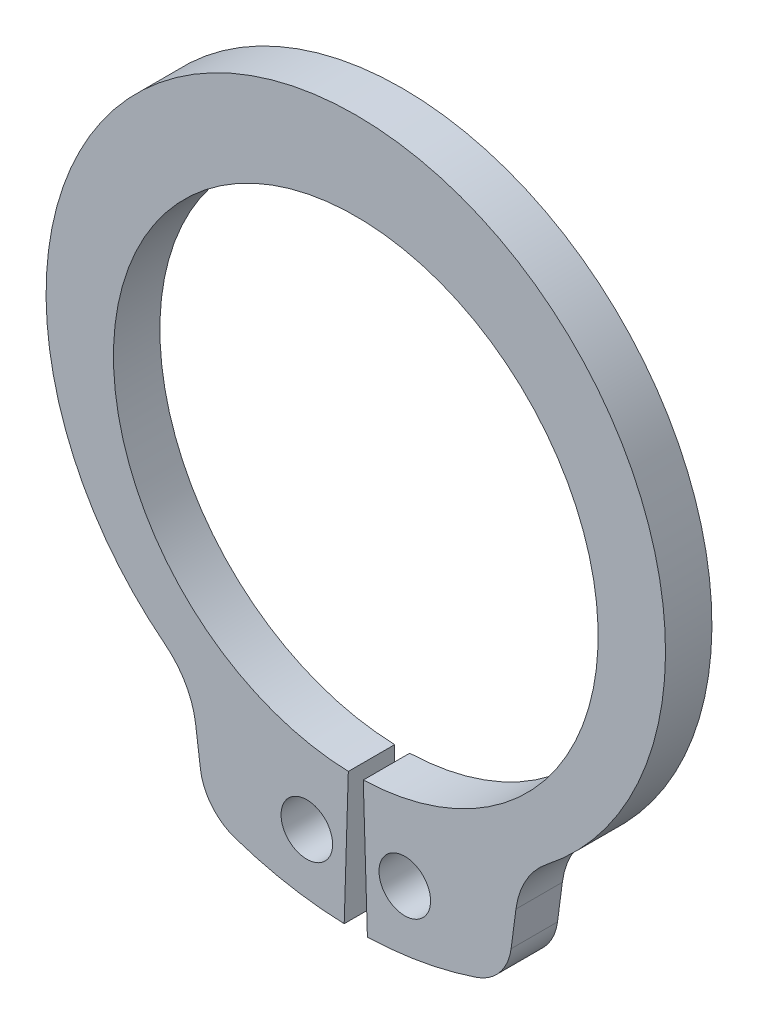
ISO-10303-21;
HEADER;
FILE_DESCRIPTION(('STEP AP214'),'2;1');
FILE_NAME('part.step','',(''),(''),'','','');
FILE_SCHEMA(('AUTOMOTIVE_DESIGN { 1 0 10303 214 1 1 1 1 }'));
ENDSEC;
DATA;
#1=APPLICATION_CONTEXT('core data for automotive mechanical design processes');
#2=APPLICATION_PROTOCOL_DEFINITION('international standard','automotive_design',2000,#1);
#3=PRODUCT_CONTEXT('',#1,'mechanical');
#4=PRODUCT('Part','Part','',(#3));
#5=PRODUCT_RELATED_PRODUCT_CATEGORY('part','',(#4));
#6=PRODUCT_DEFINITION_FORMATION('','',#4);
#7=PRODUCT_DEFINITION_CONTEXT('part definition',#1,'design');
#8=PRODUCT_DEFINITION('design','',#6,#7);
#9=PRODUCT_DEFINITION_SHAPE('','',#8);
#10=(LENGTH_UNIT() NAMED_UNIT(*) SI_UNIT(.MILLI.,.METRE.));
#11=(NAMED_UNIT(*) PLANE_ANGLE_UNIT() SI_UNIT($,.RADIAN.));
#12=(NAMED_UNIT(*) SI_UNIT($,.STERADIAN.) SOLID_ANGLE_UNIT());
#13=UNCERTAINTY_MEASURE_WITH_UNIT(LENGTH_MEASURE(1.E-05),#10,'distance_accuracy_value','');
#14=(GEOMETRIC_REPRESENTATION_CONTEXT(3) GLOBAL_UNCERTAINTY_ASSIGNED_CONTEXT((#13)) GLOBAL_UNIT_ASSIGNED_CONTEXT((#10,
#11,#12)) REPRESENTATION_CONTEXT('',''));
#15=CARTESIAN_POINT('',(0.,0.,0.));
#16=DIRECTION('',(0.,0.,1.));
#17=DIRECTION('',(1.,0.,0.));
#18=AXIS2_PLACEMENT_3D('',#15,#16,#17);
#19=CARTESIAN_POINT('',(0.,0.,-0.9));
#20=DIRECTION('',(0.,0.,1.));
#21=DIRECTION('',(1.,0.,0.));
#22=AXIS2_PLACEMENT_3D('',#19,#20,#21);
#23=CYLINDRICAL_SURFACE('',#22,4.7);
#24=CARTESIAN_POINT('',(0.,0.,0.));
#25=DIRECTION('',(0.,0.,-1.));
#26=DIRECTION('',(1.,0.,0.));
#27=AXIS2_PLACEMENT_3D('',#24,#25,#26);
#28=CIRCLE('',#27,4.7);
#29=CARTESIAN_POINT('',(-0.14486301369863,-4.69776699158889,0.));
#30=VERTEX_POINT('',#29);
#31=CARTESIAN_POINT('',(0.14486301369863,-4.69776699158889,0.));
#32=VERTEX_POINT('',#31);
#33=EDGE_CURVE('E153',#30,#32,#28,.T.);
#34=ORIENTED_EDGE('',*,*,#33,.F.);
#35=DIRECTION('',(0.,0.,1.));
#36=VECTOR('',#35,1.);
#37=CARTESIAN_POINT('',(-0.14486301369863,-4.69776699158889,-0.9));
#38=LINE('',#37,#36);
#39=CARTESIAN_POINT('',(-0.14486301369863,-4.69776699158889,-0.9));
#40=VERTEX_POINT('',#39);
#41=EDGE_CURVE('E11',#40,#30,#38,.T.);
#42=ORIENTED_EDGE('',*,*,#41,.F.);
#43=CARTESIAN_POINT('',(0.,0.,-0.9));
#44=DIRECTION('',(0.,0.,-1.));
#45=DIRECTION('',(1.,0.,0.));
#46=AXIS2_PLACEMENT_3D('',#43,#44,#45);
#47=CIRCLE('',#46,4.7);
#48=CARTESIAN_POINT('',(0.14486301369863,-4.69776699158889,-0.9));
#49=VERTEX_POINT('',#48);
#50=EDGE_CURVE('E186',#40,#49,#47,.T.);
#51=ORIENTED_EDGE('',*,*,#50,.T.);
#52=DIRECTION('',(0.,0.,1.));
#53=VECTOR('',#52,1.);
#54=CARTESIAN_POINT('',(0.14486301369863,-4.69776699158889,-0.9));
#55=LINE('',#54,#53);
#56=EDGE_CURVE('E35',#49,#32,#55,.T.);
#57=ORIENTED_EDGE('',*,*,#56,.T.);
#58=EDGE_LOOP('',(#34,#42,#51,#57));
#59=FACE_BOUND('',#58,.T.);
#60=ADVANCED_FACE('F32',(#59),#23,.F.);
#61=CARTESIAN_POINT('',(-0.14486301369863,-4.69776699158889,-0.9));
#62=DIRECTION('',(0.999524891827424,-0.0308219178082192,0.));
#63=DIRECTION('',(0.0308219178082192,0.999524891827424,0.));
#64=AXIS2_PLACEMENT_3D('',#61,#62,#63);
#65=PLANE('',#64);
#66=DIRECTION('',(0.0308219178082192,0.999524891827424,0.));
#67=VECTOR('',#66,1.);
#68=CARTESIAN_POINT('',(-0.14486301369863,-4.69776699158889,0.));
#69=LINE('',#68,#67);
#70=CARTESIAN_POINT('',(-0.225,-7.2965317103402,0.));
#71=VERTEX_POINT('',#70);
#72=EDGE_CURVE('E184',#71,#30,#69,.T.);
#73=ORIENTED_EDGE('',*,*,#72,.F.);
#74=DIRECTION('',(0.,0.,1.));
#75=VECTOR('',#74,1.);
#76=CARTESIAN_POINT('',(-0.225,-7.2965317103402,-0.9));
#77=LINE('',#76,#75);
#78=CARTESIAN_POINT('',(-0.225,-7.2965317103402,-0.9));
#79=VERTEX_POINT('',#78);
#80=EDGE_CURVE('E41',#79,#71,#77,.T.);
#81=ORIENTED_EDGE('',*,*,#80,.F.);
#82=DIRECTION('',(0.0308219178082192,0.999524891827424,0.));
#83=VECTOR('',#82,1.);
#84=CARTESIAN_POINT('',(-0.14486301369863,-4.69776699158889,-0.9));
#85=LINE('',#84,#83);
#86=EDGE_CURVE('E143',#79,#40,#85,.T.);
#87=ORIENTED_EDGE('',*,*,#86,.T.);
#88=ORIENTED_EDGE('',*,*,#41,.T.);
#89=EDGE_LOOP('',(#73,#81,#87,#88));
#90=FACE_BOUND('',#89,.T.);
#91=ADVANCED_FACE('F206',(#90),#65,.T.);
#92=CARTESIAN_POINT('',(0.,0.,-0.9));
#93=DIRECTION('',(0.,0.,1.));
#94=DIRECTION('',(1.,0.,0.));
#95=AXIS2_PLACEMENT_3D('',#92,#93,#94);
#96=CYLINDRICAL_SURFACE('',#95,7.3);
#97=CARTESIAN_POINT('',(0.,0.,0.));
#98=DIRECTION('',(0.,0.,1.));
#99=DIRECTION('',(1.,0.,0.));
#100=AXIS2_PLACEMENT_3D('',#97,#98,#99);
#101=CIRCLE('',#100,7.3);
#102=CARTESIAN_POINT('',(-2.34132501821365,-6.91434719688611,0.));
#103=VERTEX_POINT('',#102);
#104=EDGE_CURVE('E130',#103,#71,#101,.T.);
#105=ORIENTED_EDGE('',*,*,#104,.F.);
#106=DIRECTION('',(0.,0.,1.));
#107=VECTOR('',#106,1.);
#108=CARTESIAN_POINT('',(-2.34132501821365,-6.91434719688611,-0.9));
#109=LINE('',#108,#107);
#110=CARTESIAN_POINT('',(-2.34132501821365,-6.91434719688611,-0.9));
#111=VERTEX_POINT('',#110);
#112=EDGE_CURVE('E125',#111,#103,#109,.T.);
#113=ORIENTED_EDGE('',*,*,#112,.F.);
#114=CARTESIAN_POINT('',(0.,0.,-0.9));
#115=DIRECTION('',(0.,0.,1.));
#116=DIRECTION('',(1.,0.,0.));
#117=AXIS2_PLACEMENT_3D('',#114,#115,#116);
#118=CIRCLE('',#117,7.3);
#119=EDGE_CURVE('E128',#111,#79,#118,.T.);
#120=ORIENTED_EDGE('',*,*,#119,.T.);
#121=ORIENTED_EDGE('',*,*,#80,.T.);
#122=EDGE_LOOP('',(#105,#113,#120,#121));
#123=FACE_BOUND('',#122,.T.);
#124=ADVANCED_FACE('F127',(#123),#96,.T.);
#125=CARTESIAN_POINT('',(-2.02059556366383,-5.96717634799761,-0.9));
#126=DIRECTION('',(0.,0.,1.));
#127=DIRECTION('',(1.,0.,0.));
#128=AXIS2_PLACEMENT_3D('',#125,#126,#127);
#129=CYLINDRICAL_SURFACE('',#128,0.999999999999999);
#130=CARTESIAN_POINT('',(-2.02059556366383,-5.96717634799761,0.));
#131=DIRECTION('',(0.,0.,1.));
#132=DIRECTION('',(1.,0.,0.));
#133=AXIS2_PLACEMENT_3D('',#130,#131,#132);
#134=CIRCLE('',#133,0.999999999999999);
#135=CARTESIAN_POINT('',(-3.01204042503764,-6.09770254021766,0.));
#136=VERTEX_POINT('',#135);
#137=EDGE_CURVE('E181',#136,#103,#134,.T.);
#138=ORIENTED_EDGE('',*,*,#137,.F.);
#139=DIRECTION('',(0.,0.,1.));
#140=VECTOR('',#139,1.);
#141=CARTESIAN_POINT('',(-3.01204042503764,-6.09770254021766,-0.9));
#142=LINE('',#141,#140);
#143=CARTESIAN_POINT('',(-3.01204042503764,-6.09770254021766,-0.9));
#144=VERTEX_POINT('',#143);
#145=EDGE_CURVE('E135',#144,#136,#142,.T.);
#146=ORIENTED_EDGE('',*,*,#145,.F.);
#147=CARTESIAN_POINT('',(-2.02059556366383,-5.96717634799761,-0.9));
#148=DIRECTION('',(0.,0.,1.));
#149=DIRECTION('',(1.,0.,0.));
#150=AXIS2_PLACEMENT_3D('',#147,#148,#149);
#151=CIRCLE('',#150,0.999999999999999);
#152=EDGE_CURVE('E141',#144,#111,#151,.T.);
#153=ORIENTED_EDGE('',*,*,#152,.T.);
#154=ORIENTED_EDGE('',*,*,#112,.T.);
#155=EDGE_LOOP('',(#138,#146,#153,#154));
#156=FACE_BOUND('',#155,.T.);
#157=ADVANCED_FACE('F145',(#156),#129,.T.);
#158=CARTESIAN_POINT('',(-3.10594339973383,-5.38443863397194,-0.9));
#159=DIRECTION('',(-0.99144486137381,-0.130526192220052,0.));
#160=DIRECTION('',(0.130526192220052,-0.99144486137381,0.));
#161=AXIS2_PLACEMENT_3D('',#158,#159,#160);
#162=PLANE('',#161);
#163=DIRECTION('',(0.130526192220052,-0.99144486137381,0.));
#164=VECTOR('',#163,1.);
#165=CARTESIAN_POINT('',(-3.10594339973383,-5.38443863397194,0.));
#166=LINE('',#165,#164);
#167=CARTESIAN_POINT('',(-3.10594339973383,-5.38443863397194,0.));
#168=VERTEX_POINT('',#167);
#169=EDGE_CURVE('E178',#168,#136,#166,.T.);
#170=ORIENTED_EDGE('',*,*,#169,.F.);
#171=DIRECTION('',(0.,0.,1.));
#172=VECTOR('',#171,1.);
#173=CARTESIAN_POINT('',(-3.10594339973383,-5.38443863397194,-0.9));
#174=LINE('',#173,#172);
#175=CARTESIAN_POINT('',(-3.10594339973383,-5.38443863397194,-0.9));
#176=VERTEX_POINT('',#175);
#177=EDGE_CURVE('E190',#176,#168,#174,.T.);
#178=ORIENTED_EDGE('',*,*,#177,.F.);
#179=DIRECTION('',(0.130526192220052,-0.99144486137381,0.));
#180=VECTOR('',#179,1.);
#181=CARTESIAN_POINT('',(-3.10594339973383,-5.38443863397194,-0.9));
#182=LINE('',#181,#180);
#183=EDGE_CURVE('E146',#176,#144,#182,.T.);
#184=ORIENTED_EDGE('',*,*,#183,.T.);
#185=ORIENTED_EDGE('',*,*,#145,.T.);
#186=EDGE_LOOP('',(#170,#178,#184,#185));
#187=FACE_BOUND('',#186,.T.);
#188=ADVANCED_FACE('F219',(#187),#162,.T.);
#189=CARTESIAN_POINT('',(-4.69114558530059,-5.5931344608828,-0.9));
#190=DIRECTION('',(0.,0.,1.));
#191=DIRECTION('',(1.,0.,0.));
#192=AXIS2_PLACEMENT_3D('',#189,#190,#191);
#193=CYLINDRICAL_SURFACE('',#192,1.59888083273759);
#194=CARTESIAN_POINT('',(-4.69114558530059,-5.5931344608828,0.));
#195=DIRECTION('',(0.,0.,-1.));
#196=DIRECTION('',(1.,0.,0.));
#197=AXIS2_PLACEMENT_3D('',#194,#195,#196);
#198=CIRCLE('',#197,1.59888083273759);
#199=CARTESIAN_POINT('',(-3.70494804841892,-4.33462965932495,0.));
#200=VERTEX_POINT('',#199);
#201=EDGE_CURVE('E175',#200,#168,#198,.T.);
#202=ORIENTED_EDGE('',*,*,#201,.F.);
#203=DIRECTION('',(0.,0.,1.));
#204=VECTOR('',#203,1.);
#205=CARTESIAN_POINT('',(-3.70494804841892,-4.33462965932495,-0.9));
#206=LINE('',#205,#204);
#207=CARTESIAN_POINT('',(-3.70494804841892,-4.33462965932495,-0.9));
#208=VERTEX_POINT('',#207);
#209=EDGE_CURVE('E192',#208,#200,#206,.T.);
#210=ORIENTED_EDGE('',*,*,#209,.F.);
#211=CARTESIAN_POINT('',(-4.69114558530059,-5.5931344608828,-0.9));
#212=DIRECTION('',(0.,0.,-1.));
#213=DIRECTION('',(1.,0.,0.));
#214=AXIS2_PLACEMENT_3D('',#211,#212,#213);
#215=CIRCLE('',#214,1.59888083273759);
#216=EDGE_CURVE('E148',#208,#176,#215,.T.);
#217=ORIENTED_EDGE('',*,*,#216,.T.);
#218=ORIENTED_EDGE('',*,*,#177,.T.);
#219=EDGE_LOOP('',(#202,#210,#217,#218));
#220=FACE_BOUND('',#219,.T.);
#221=ADVANCED_FACE('F222',(#220),#193,.F.);
#222=CARTESIAN_POINT('',(0.,0.393322636318519,-0.9));
#223=DIRECTION('',(0.,0.,1.));
#224=DIRECTION('',(1.,0.,0.));
#225=AXIS2_PLACEMENT_3D('',#222,#223,#224);
#226=CYLINDRICAL_SURFACE('',#225,6.00667736368148);
#227=CARTESIAN_POINT('',(0.,0.393322636318519,0.));
#228=DIRECTION('',(0.,0.,1.));
#229=DIRECTION('',(1.,0.,0.));
#230=AXIS2_PLACEMENT_3D('',#227,#228,#229);
#231=CIRCLE('',#230,6.00667736368148);
#232=CARTESIAN_POINT('',(3.70494804841892,-4.33462965932495,0.));
#233=VERTEX_POINT('',#232);
#234=EDGE_CURVE('E172',#233,#200,#231,.T.);
#235=ORIENTED_EDGE('',*,*,#234,.F.);
#236=DIRECTION('',(0.,0.,1.));
#237=VECTOR('',#236,1.);
#238=CARTESIAN_POINT('',(3.70494804841892,-4.33462965932495,-0.9));
#239=LINE('',#238,#237);
#240=CARTESIAN_POINT('',(3.70494804841892,-4.33462965932495,-0.9));
#241=VERTEX_POINT('',#240);
#242=EDGE_CURVE('E194',#241,#233,#239,.T.);
#243=ORIENTED_EDGE('',*,*,#242,.F.);
#244=CARTESIAN_POINT('',(0.,0.393322636318519,-0.9));
#245=DIRECTION('',(0.,0.,1.));
#246=DIRECTION('',(1.,0.,0.));
#247=AXIS2_PLACEMENT_3D('',#244,#245,#246);
#248=CIRCLE('',#247,6.00667736368148);
#249=EDGE_CURVE('E296',#241,#208,#248,.T.);
#250=ORIENTED_EDGE('',*,*,#249,.T.);
#251=ORIENTED_EDGE('',*,*,#209,.T.);
#252=EDGE_LOOP('',(#235,#243,#250,#251));
#253=FACE_BOUND('',#252,.T.);
#254=ADVANCED_FACE('F226',(#253),#226,.T.);
#255=CARTESIAN_POINT('',(4.69114558530059,-5.5931344608828,-0.9));
#256=DIRECTION('',(0.,0.,1.));
#257=DIRECTION('',(1.,0.,0.));
#258=AXIS2_PLACEMENT_3D('',#255,#256,#257);
#259=CYLINDRICAL_SURFACE('',#258,1.59888083273759);
#260=CARTESIAN_POINT('',(4.69114558530059,-5.5931344608828,0.));
#261=DIRECTION('',(0.,0.,-1.));
#262=DIRECTION('',(1.,0.,0.));
#263=AXIS2_PLACEMENT_3D('',#260,#261,#262);
#264=CIRCLE('',#263,1.59888083273759);
#265=CARTESIAN_POINT('',(3.10594339973383,-5.38443863397194,0.));
#266=VERTEX_POINT('',#265);
#267=EDGE_CURVE('E169',#266,#233,#264,.T.);
#268=ORIENTED_EDGE('',*,*,#267,.F.);
#269=DIRECTION('',(0.,0.,1.));
#270=VECTOR('',#269,1.);
#271=CARTESIAN_POINT('',(3.10594339973383,-5.38443863397194,-0.9));
#272=LINE('',#271,#270);
#273=CARTESIAN_POINT('',(3.10594339973383,-5.38443863397194,-0.9));
#274=VERTEX_POINT('',#273);
#275=EDGE_CURVE('E196',#274,#266,#272,.T.);
#276=ORIENTED_EDGE('',*,*,#275,.F.);
#277=CARTESIAN_POINT('',(4.69114558530059,-5.5931344608828,-0.9));
#278=DIRECTION('',(0.,0.,-1.));
#279=DIRECTION('',(1.,0.,0.));
#280=AXIS2_PLACEMENT_3D('',#277,#278,#279);
#281=CIRCLE('',#280,1.59888083273759);
#282=EDGE_CURVE('E293',#274,#241,#281,.T.);
#283=ORIENTED_EDGE('',*,*,#282,.T.);
#284=ORIENTED_EDGE('',*,*,#242,.T.);
#285=EDGE_LOOP('',(#268,#276,#283,#284));
#286=FACE_BOUND('',#285,.T.);
#287=ADVANCED_FACE('F230',(#286),#259,.F.);
#288=CARTESIAN_POINT('',(3.10594339973383,-5.38443863397194,-0.9));
#289=DIRECTION('',(0.99144486137381,-0.130526192220052,0.));
#290=DIRECTION('',(0.130526192220052,0.99144486137381,0.));
#291=AXIS2_PLACEMENT_3D('',#288,#289,#290);
#292=PLANE('',#291);
#293=DIRECTION('',(0.130526192220052,0.99144486137381,0.));
#294=VECTOR('',#293,1.);
#295=CARTESIAN_POINT('',(3.10594339973383,-5.38443863397194,0.));
#296=LINE('',#295,#294);
#297=CARTESIAN_POINT('',(3.01204042503764,-6.09770254021766,0.));
#298=VERTEX_POINT('',#297);
#299=EDGE_CURVE('E166',#298,#266,#296,.T.);
#300=ORIENTED_EDGE('',*,*,#299,.F.);
#301=DIRECTION('',(0.,0.,1.));
#302=VECTOR('',#301,1.);
#303=CARTESIAN_POINT('',(3.01204042503764,-6.09770254021766,-0.9));
#304=LINE('',#303,#302);
#305=CARTESIAN_POINT('',(3.01204042503764,-6.09770254021766,-0.9));
#306=VERTEX_POINT('',#305);
#307=EDGE_CURVE('E198',#306,#298,#304,.T.);
#308=ORIENTED_EDGE('',*,*,#307,.F.);
#309=DIRECTION('',(0.130526192220052,0.99144486137381,0.));
#310=VECTOR('',#309,1.);
#311=CARTESIAN_POINT('',(3.10594339973383,-5.38443863397194,-0.9));
#312=LINE('',#311,#310);
#313=EDGE_CURVE('E290',#306,#274,#312,.T.);
#314=ORIENTED_EDGE('',*,*,#313,.T.);
#315=ORIENTED_EDGE('',*,*,#275,.T.);
#316=EDGE_LOOP('',(#300,#308,#314,#315));
#317=FACE_BOUND('',#316,.T.);
#318=ADVANCED_FACE('F234',(#317),#292,.T.);
#319=CARTESIAN_POINT('',(2.02059556366383,-5.96717634799761,-0.9));
#320=DIRECTION('',(0.,0.,1.));
#321=DIRECTION('',(1.,0.,0.));
#322=AXIS2_PLACEMENT_3D('',#319,#320,#321);
#323=CYLINDRICAL_SURFACE('',#322,0.999999999999999);
#324=CARTESIAN_POINT('',(2.02059556366383,-5.96717634799761,0.));
#325=DIRECTION('',(0.,0.,1.));
#326=DIRECTION('',(-1.,0.,0.));
#327=AXIS2_PLACEMENT_3D('',#324,#325,#326);
#328=CIRCLE('',#327,0.999999999999999);
#329=CARTESIAN_POINT('',(2.34132501821364,-6.91434719688612,0.));
#330=VERTEX_POINT('',#329);
#331=EDGE_CURVE('E163',#330,#298,#328,.T.);
#332=ORIENTED_EDGE('',*,*,#331,.F.);
#333=DIRECTION('',(0.,0.,1.));
#334=VECTOR('',#333,1.);
#335=CARTESIAN_POINT('',(2.34132501821364,-6.91434719688612,-0.9));
#336=LINE('',#335,#334);
#337=CARTESIAN_POINT('',(2.34132501821364,-6.91434719688612,-0.9));
#338=VERTEX_POINT('',#337);
#339=EDGE_CURVE('E200',#338,#330,#336,.T.);
#340=ORIENTED_EDGE('',*,*,#339,.F.);
#341=CARTESIAN_POINT('',(2.02059556366383,-5.96717634799761,-0.9));
#342=DIRECTION('',(0.,0.,1.));
#343=DIRECTION('',(-1.,0.,0.));
#344=AXIS2_PLACEMENT_3D('',#341,#342,#343);
#345=CIRCLE('',#344,0.999999999999999);
#346=EDGE_CURVE('E287',#338,#306,#345,.T.);
#347=ORIENTED_EDGE('',*,*,#346,.T.);
#348=ORIENTED_EDGE('',*,*,#307,.T.);
#349=EDGE_LOOP('',(#332,#340,#347,#348));
#350=FACE_BOUND('',#349,.T.);
#351=ADVANCED_FACE('F238',(#350),#323,.T.);
#352=CARTESIAN_POINT('',(0.,0.,-0.9));
#353=DIRECTION('',(0.,0.,1.));
#354=DIRECTION('',(1.,0.,0.));
#355=AXIS2_PLACEMENT_3D('',#352,#353,#354);
#356=CYLINDRICAL_SURFACE('',#355,7.3);
#357=CARTESIAN_POINT('',(0.,0.,0.));
#358=DIRECTION('',(0.,0.,1.));
#359=DIRECTION('',(1.,0.,0.));
#360=AXIS2_PLACEMENT_3D('',#357,#358,#359);
#361=CIRCLE('',#360,7.3);
#362=CARTESIAN_POINT('',(0.225000000000001,-7.29653171034019,0.));
#363=VERTEX_POINT('',#362);
#364=EDGE_CURVE('E160',#363,#330,#361,.T.);
#365=ORIENTED_EDGE('',*,*,#364,.F.);
#366=DIRECTION('',(0.,0.,1.));
#367=VECTOR('',#366,1.);
#368=CARTESIAN_POINT('',(0.225000000000001,-7.29653171034019,-0.9));
#369=LINE('',#368,#367);
#370=CARTESIAN_POINT('',(0.225000000000001,-7.29653171034019,-0.9));
#371=VERTEX_POINT('',#370);
#372=EDGE_CURVE('E201',#371,#363,#369,.T.);
#373=ORIENTED_EDGE('',*,*,#372,.F.);
#374=CARTESIAN_POINT('',(0.,0.,-0.9));
#375=DIRECTION('',(0.,0.,1.));
#376=DIRECTION('',(1.,0.,0.));
#377=AXIS2_PLACEMENT_3D('',#374,#375,#376);
#378=CIRCLE('',#377,7.3);
#379=EDGE_CURVE('E284',#371,#338,#378,.T.);
#380=ORIENTED_EDGE('',*,*,#379,.T.);
#381=ORIENTED_EDGE('',*,*,#339,.T.);
#382=EDGE_LOOP('',(#365,#373,#380,#381));
#383=FACE_BOUND('',#382,.T.);
#384=ADVANCED_FACE('F242',(#383),#356,.T.);
#385=CARTESIAN_POINT('',(0.14486301369863,-4.69776699158889,-0.9));
#386=DIRECTION('',(-0.999524891827424,-0.0308219178082192,0.));
#387=DIRECTION('',(0.0308219178082192,-0.999524891827424,0.));
#388=AXIS2_PLACEMENT_3D('',#385,#386,#387);
#389=PLANE('',#388);
#390=DIRECTION('',(0.0308219178082192,-0.999524891827424,0.));
#391=VECTOR('',#390,1.);
#392=CARTESIAN_POINT('',(0.14486301369863,-4.69776699158889,0.));
#393=LINE('',#392,#391);
#394=EDGE_CURVE('E156',#32,#363,#393,.T.);
#395=ORIENTED_EDGE('',*,*,#394,.F.);
#396=ORIENTED_EDGE('',*,*,#56,.F.);
#397=DIRECTION('',(0.0308219178082192,-0.999524891827424,0.));
#398=VECTOR('',#397,1.);
#399=CARTESIAN_POINT('',(0.14486301369863,-4.69776699158889,-0.9));
#400=LINE('',#399,#398);
#401=EDGE_CURVE('E282',#49,#371,#400,.T.);
#402=ORIENTED_EDGE('',*,*,#401,.T.);
#403=ORIENTED_EDGE('',*,*,#372,.T.);
#404=EDGE_LOOP('',(#395,#396,#402,#403));
#405=FACE_BOUND('',#404,.T.);
#406=ADVANCED_FACE('F203',(#405),#389,.T.);
#407=CARTESIAN_POINT('',(0.,0.,-0.9));
#408=DIRECTION('',(0.,0.,1.));
#409=DIRECTION('',(1.,0.,0.));
#410=AXIS2_PLACEMENT_3D('',#407,#408,#409);
#411=PLANE('',#410);
#412=CARTESIAN_POINT('',(-0.95,-6.07618301238532,-0.9));
#413=DIRECTION('',(0.,0.,1.));
#414=DIRECTION('',(1.,0.,0.));
#415=AXIS2_PLACEMENT_3D('',#412,#413,#414);
#416=CIRCLE('',#415,0.5);
#417=CARTESIAN_POINT('',(-0.45,-6.07618301238532,-0.9));
#418=VERTEX_POINT('',#417);
#419=EDGE_CURVE('E269',#418,#418,#416,.T.);
#420=ORIENTED_EDGE('',*,*,#419,.T.);
#421=EDGE_LOOP('',(#420));
#422=FACE_BOUND('',#421,.T.);
#423=CARTESIAN_POINT('',(0.95,-6.07618301238532,-0.9));
#424=DIRECTION('',(0.,0.,1.));
#425=DIRECTION('',(1.,0.,0.));
#426=AXIS2_PLACEMENT_3D('',#423,#424,#425);
#427=CIRCLE('',#426,0.5);
#428=CARTESIAN_POINT('',(1.45,-6.07618301238532,-0.9));
#429=VERTEX_POINT('',#428);
#430=EDGE_CURVE('E157',#429,#429,#427,.T.);
#431=ORIENTED_EDGE('',*,*,#430,.T.);
#432=EDGE_LOOP('',(#431));
#433=FACE_BOUND('',#432,.T.);
#434=ORIENTED_EDGE('',*,*,#50,.F.);
#435=ORIENTED_EDGE('',*,*,#86,.F.);
#436=ORIENTED_EDGE('',*,*,#119,.F.);
#437=ORIENTED_EDGE('',*,*,#152,.F.);
#438=ORIENTED_EDGE('',*,*,#183,.F.);
#439=ORIENTED_EDGE('',*,*,#216,.F.);
#440=ORIENTED_EDGE('',*,*,#249,.F.);
#441=ORIENTED_EDGE('',*,*,#282,.F.);
#442=ORIENTED_EDGE('',*,*,#313,.F.);
#443=ORIENTED_EDGE('',*,*,#346,.F.);
#444=ORIENTED_EDGE('',*,*,#379,.F.);
#445=ORIENTED_EDGE('',*,*,#401,.F.);
#446=EDGE_LOOP('',(#434,#435,#436,#437,#438,#439,#440,#441,#442,#443,#444,#445));
#447=FACE_BOUND('',#446,.T.);
#448=ADVANCED_FACE('F139',(#422,#433,#447),#411,.F.);
#449=CARTESIAN_POINT('',(0.,0.,0.));
#450=DIRECTION('',(0.,0.,1.));
#451=DIRECTION('',(1.,0.,0.));
#452=AXIS2_PLACEMENT_3D('',#449,#450,#451);
#453=PLANE('',#452);
#454=CARTESIAN_POINT('',(-0.95,-6.07618301238532,0.));
#455=DIRECTION('',(0.,0.,1.));
#456=DIRECTION('',(1.,0.,0.));
#457=AXIS2_PLACEMENT_3D('',#454,#455,#456);
#458=CIRCLE('',#457,0.5);
#459=CARTESIAN_POINT('',(-0.45,-6.07618301238532,0.));
#460=VERTEX_POINT('',#459);
#461=EDGE_CURVE('E272',#460,#460,#458,.T.);
#462=ORIENTED_EDGE('',*,*,#461,.F.);
#463=EDGE_LOOP('',(#462));
#464=FACE_BOUND('',#463,.T.);
#465=CARTESIAN_POINT('',(0.95,-6.07618301238532,0.));
#466=DIRECTION('',(0.,0.,1.));
#467=DIRECTION('',(1.,0.,0.));
#468=AXIS2_PLACEMENT_3D('',#465,#466,#467);
#469=CIRCLE('',#468,0.5);
#470=CARTESIAN_POINT('',(1.45,-6.07618301238532,0.));
#471=VERTEX_POINT('',#470);
#472=EDGE_CURVE('E274',#471,#471,#469,.T.);
#473=ORIENTED_EDGE('',*,*,#472,.F.);
#474=EDGE_LOOP('',(#473));
#475=FACE_BOUND('',#474,.T.);
#476=ORIENTED_EDGE('',*,*,#33,.T.);
#477=ORIENTED_EDGE('',*,*,#394,.T.);
#478=ORIENTED_EDGE('',*,*,#364,.T.);
#479=ORIENTED_EDGE('',*,*,#331,.T.);
#480=ORIENTED_EDGE('',*,*,#299,.T.);
#481=ORIENTED_EDGE('',*,*,#267,.T.);
#482=ORIENTED_EDGE('',*,*,#234,.T.);
#483=ORIENTED_EDGE('',*,*,#201,.T.);
#484=ORIENTED_EDGE('',*,*,#169,.T.);
#485=ORIENTED_EDGE('',*,*,#137,.T.);
#486=ORIENTED_EDGE('',*,*,#104,.T.);
#487=ORIENTED_EDGE('',*,*,#72,.T.);
#488=EDGE_LOOP('',(#476,#477,#478,#479,#480,#481,#482,#483,#484,#485,#486,#487));
#489=FACE_BOUND('',#488,.T.);
#490=ADVANCED_FACE('F205',(#464,#475,#489),#453,.T.);
#491=CARTESIAN_POINT('',(0.95,-6.07618301238532,-0.9));
#492=DIRECTION('',(0.,0.,1.));
#493=DIRECTION('',(1.,0.,0.));
#494=AXIS2_PLACEMENT_3D('',#491,#492,#493);
#495=CYLINDRICAL_SURFACE('',#494,0.5);
#496=ORIENTED_EDGE('',*,*,#430,.F.);
#497=EDGE_LOOP('',(#496));
#498=FACE_BOUND('',#497,.T.);
#499=ORIENTED_EDGE('',*,*,#472,.T.);
#500=EDGE_LOOP('',(#499));
#501=FACE_BOUND('',#500,.T.);
#502=ADVANCED_FACE('F254',(#498,#501),#495,.F.);
#503=CARTESIAN_POINT('',(-0.95,-6.07618301238532,-0.9));
#504=DIRECTION('',(0.,0.,1.));
#505=DIRECTION('',(1.,0.,0.));
#506=AXIS2_PLACEMENT_3D('',#503,#504,#505);
#507=CYLINDRICAL_SURFACE('',#506,0.5);
#508=ORIENTED_EDGE('',*,*,#419,.F.);
#509=EDGE_LOOP('',(#508));
#510=FACE_BOUND('',#509,.T.);
#511=ORIENTED_EDGE('',*,*,#461,.T.);
#512=EDGE_LOOP('',(#511));
#513=FACE_BOUND('',#512,.T.);
#514=ADVANCED_FACE('F261',(#510,#513),#507,.F.);
#515=CLOSED_SHELL('',(#60,#91,#124,#157,#188,#221,#254,#287,#318,#351,#384,#406,#448,#490,#502,#514));
#516=MANIFOLD_SOLID_BREP('B2',#515);
#517=ADVANCED_BREP_SHAPE_REPRESENTATION('',(#18,#516),#14);
#518=SHAPE_DEFINITION_REPRESENTATION(#9,#517);
ENDSEC;
END-ISO-10303-21;
